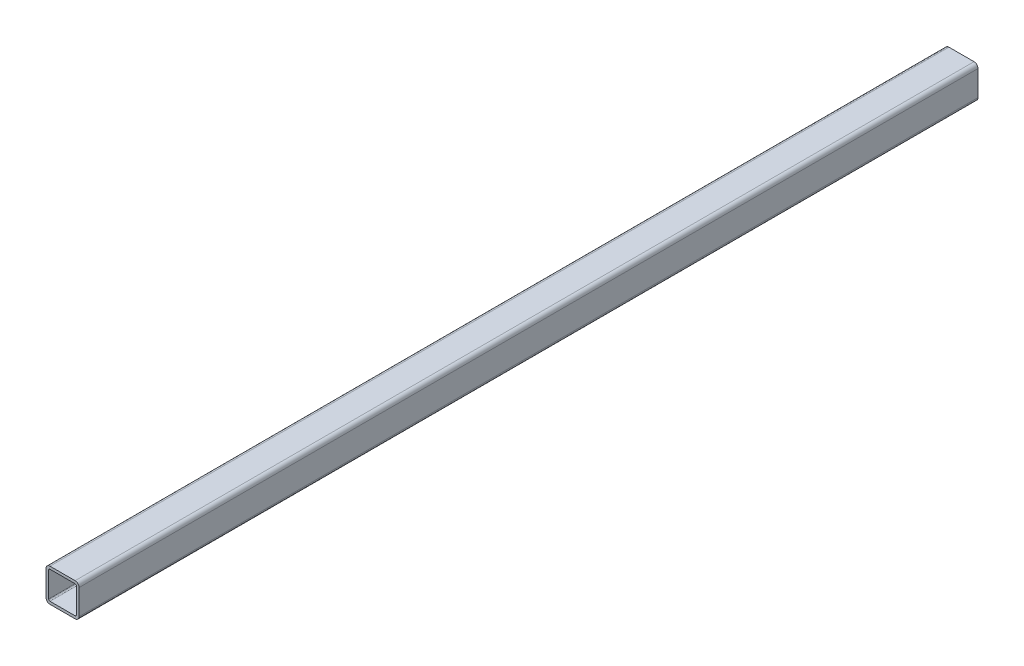
ISO-10303-21;
HEADER;
FILE_DESCRIPTION(('STEP AP214'),'2;1');
FILE_NAME('part.step','',(''),(''),'','','');
FILE_SCHEMA(('AUTOMOTIVE_DESIGN { 1 0 10303 214 1 1 1 1 }'));
ENDSEC;
DATA;
#1=APPLICATION_CONTEXT('core data for automotive mechanical design processes');
#2=APPLICATION_PROTOCOL_DEFINITION('international standard','automotive_design',2000,#1);
#3=PRODUCT_CONTEXT('',#1,'mechanical');
#4=PRODUCT('Part','Part','',(#3));
#5=PRODUCT_RELATED_PRODUCT_CATEGORY('part','',(#4));
#6=PRODUCT_DEFINITION_FORMATION('','',#4);
#7=PRODUCT_DEFINITION_CONTEXT('part definition',#1,'design');
#8=PRODUCT_DEFINITION('design','',#6,#7);
#9=PRODUCT_DEFINITION_SHAPE('','',#8);
#10=(LENGTH_UNIT() NAMED_UNIT(*) SI_UNIT(.MILLI.,.METRE.));
#11=(NAMED_UNIT(*) PLANE_ANGLE_UNIT() SI_UNIT($,.RADIAN.));
#12=(NAMED_UNIT(*) SI_UNIT($,.STERADIAN.) SOLID_ANGLE_UNIT());
#13=UNCERTAINTY_MEASURE_WITH_UNIT(LENGTH_MEASURE(1.E-05),#10,'distance_accuracy_value','');
#14=(GEOMETRIC_REPRESENTATION_CONTEXT(3) GLOBAL_UNCERTAINTY_ASSIGNED_CONTEXT((#13)) GLOBAL_UNIT_ASSIGNED_CONTEXT((#10,
#11,#12)) REPRESENTATION_CONTEXT('',''));
#15=CARTESIAN_POINT('',(0.,0.,0.));
#16=DIRECTION('',(0.,0.,1.));
#17=DIRECTION('',(1.,0.,0.));
#18=AXIS2_PLACEMENT_3D('',#15,#16,#17);
#19=CARTESIAN_POINT('',(-4.54747350886464E-12,-9.80993064558788E-12,680.000000000012));
#20=DIRECTION('',(0.,0.,1.));
#21=DIRECTION('',(1.,0.,0.));
#22=AXIS2_PLACEMENT_3D('',#19,#20,#21);
#23=PLANE('',#22);
#24=DIRECTION('',(0.,1.,0.));
#25=VECTOR('',#24,1.);
#26=CARTESIAN_POINT('',(-12.5000000000045,-4.75000000000982,680.000000000012));
#27=LINE('',#26,#25);
#28=CARTESIAN_POINT('',(-12.5000000000045,-9.50000000000982,680.000000000012));
#29=VERTEX_POINT('',#28);
#30=CARTESIAN_POINT('',(-12.5000000000045,9.49999999999018,680.000000000012));
#31=VERTEX_POINT('',#30);
#32=EDGE_CURVE('E222',#29,#31,#27,.T.);
#33=ORIENTED_EDGE('',*,*,#32,.F.);
#34=CARTESIAN_POINT('',(-9.50000000000458,-9.50000000000982,680.000000000012));
#35=DIRECTION('',(0.,0.,-1.));
#36=DIRECTION('',(1.,0.,0.));
#37=AXIS2_PLACEMENT_3D('',#34,#35,#36);
#38=CIRCLE('',#37,3.);
#39=CARTESIAN_POINT('',(-9.50000000000458,-12.5000000000098,680.000000000012));
#40=VERTEX_POINT('',#39);
#41=EDGE_CURVE('E186',#40,#29,#38,.T.);
#42=ORIENTED_EDGE('',*,*,#41,.F.);
#43=DIRECTION('',(-1.,0.,0.));
#44=VECTOR('',#43,1.);
#45=CARTESIAN_POINT('',(4.7499999999954,-12.5000000000098,680.000000000012));
#46=LINE('',#45,#44);
#47=CARTESIAN_POINT('',(9.49999999999548,-12.5000000000098,680.000000000012));
#48=VERTEX_POINT('',#47);
#49=EDGE_CURVE('E199',#48,#40,#46,.T.);
#50=ORIENTED_EDGE('',*,*,#49,.F.);
#51=CARTESIAN_POINT('',(9.49999999999548,-9.5000000000098,680.000000000012));
#52=DIRECTION('',(0.,0.,-1.));
#53=DIRECTION('',(0.,1.,0.));
#54=AXIS2_PLACEMENT_3D('',#51,#52,#53);
#55=CIRCLE('',#54,3.);
#56=CARTESIAN_POINT('',(12.4999999999955,-9.5000000000098,680.000000000012));
#57=VERTEX_POINT('',#56);
#58=EDGE_CURVE('E202',#57,#48,#55,.T.);
#59=ORIENTED_EDGE('',*,*,#58,.F.);
#60=DIRECTION('',(0.,-1.,0.));
#61=VECTOR('',#60,1.);
#62=CARTESIAN_POINT('',(12.4999999999955,4.7499999999902,680.000000000012));
#63=LINE('',#62,#61);
#64=CARTESIAN_POINT('',(12.4999999999955,9.4999999999902,680.000000000012));
#65=VERTEX_POINT('',#64);
#66=EDGE_CURVE('E218',#65,#57,#63,.T.);
#67=ORIENTED_EDGE('',*,*,#66,.F.);
#68=CARTESIAN_POINT('',(9.49999999999548,9.4999999999902,680.000000000012));
#69=DIRECTION('',(0.,0.,-1.));
#70=DIRECTION('',(-1.,0.,0.));
#71=AXIS2_PLACEMENT_3D('',#68,#69,#70);
#72=CIRCLE('',#71,3.);
#73=CARTESIAN_POINT('',(9.49999999999548,12.4999999999902,680.000000000012));
#74=VERTEX_POINT('',#73);
#75=EDGE_CURVE('E26',#74,#65,#72,.T.);
#76=ORIENTED_EDGE('',*,*,#75,.F.);
#77=DIRECTION('',(1.,0.,0.));
#78=VECTOR('',#77,1.);
#79=CARTESIAN_POINT('',(-4.75000000000449,12.4999999999902,680.000000000012));
#80=LINE('',#79,#78);
#81=CARTESIAN_POINT('',(-9.50000000000458,12.4999999999902,680.000000000012));
#82=VERTEX_POINT('',#81);
#83=EDGE_CURVE('E227',#82,#74,#80,.T.);
#84=ORIENTED_EDGE('',*,*,#83,.F.);
#85=CARTESIAN_POINT('',(-9.50000000000458,9.49999999999018,680.000000000012));
#86=DIRECTION('',(0.,0.,-1.));
#87=DIRECTION('',(0.,-1.,0.));
#88=AXIS2_PLACEMENT_3D('',#85,#86,#87);
#89=CIRCLE('',#88,3.);
#90=EDGE_CURVE('E248',#31,#82,#89,.T.);
#91=ORIENTED_EDGE('',*,*,#90,.F.);
#92=EDGE_LOOP('',(#33,#42,#50,#59,#67,#76,#84,#91));
#93=FACE_BOUND('',#92,.T.);
#94=DIRECTION('',(-1.,0.,0.));
#95=VECTOR('',#94,1.);
#96=CARTESIAN_POINT('',(-4.75000000000449,10.4999999999902,680.000000000012));
#97=LINE('',#96,#95);
#98=CARTESIAN_POINT('',(9.49999999999548,10.4999999999902,680.000000000012));
#99=VERTEX_POINT('',#98);
#100=CARTESIAN_POINT('',(-9.50000000000458,10.4999999999902,680.000000000012));
#101=VERTEX_POINT('',#100);
#102=EDGE_CURVE('E266',#99,#101,#97,.T.);
#103=ORIENTED_EDGE('',*,*,#102,.F.);
#104=CARTESIAN_POINT('',(9.49999999999548,9.4999999999902,680.000000000012));
#105=DIRECTION('',(0.,0.,1.));
#106=DIRECTION('',(-1.,0.,0.));
#107=AXIS2_PLACEMENT_3D('',#104,#105,#106);
#108=CIRCLE('',#107,1.);
#109=CARTESIAN_POINT('',(10.4999999999954,9.4999999999902,680.000000000012));
#110=VERTEX_POINT('',#109);
#111=EDGE_CURVE('E400',#110,#99,#108,.T.);
#112=ORIENTED_EDGE('',*,*,#111,.F.);
#113=DIRECTION('',(0.,1.,0.));
#114=VECTOR('',#113,1.);
#115=CARTESIAN_POINT('',(10.4999999999954,4.7499999999902,680.000000000012));
#116=LINE('',#115,#114);
#117=CARTESIAN_POINT('',(10.4999999999954,-9.5000000000098,680.000000000012));
#118=VERTEX_POINT('',#117);
#119=EDGE_CURVE('E246',#118,#110,#116,.T.);
#120=ORIENTED_EDGE('',*,*,#119,.F.);
#121=CARTESIAN_POINT('',(9.49999999999548,-9.5000000000098,680.000000000012));
#122=DIRECTION('',(0.,0.,1.));
#123=DIRECTION('',(0.,1.,0.));
#124=AXIS2_PLACEMENT_3D('',#121,#122,#123);
#125=CIRCLE('',#124,1.);
#126=CARTESIAN_POINT('',(9.49999999999548,-10.5000000000098,680.000000000012));
#127=VERTEX_POINT('',#126);
#128=EDGE_CURVE('E258',#127,#118,#125,.T.);
#129=ORIENTED_EDGE('',*,*,#128,.F.);
#130=DIRECTION('',(1.,0.,0.));
#131=VECTOR('',#130,1.);
#132=CARTESIAN_POINT('',(4.7499999999954,-10.5000000000098,680.000000000012));
#133=LINE('',#132,#131);
#134=CARTESIAN_POINT('',(-9.50000000000458,-10.5000000000098,680.000000000012));
#135=VERTEX_POINT('',#134);
#136=EDGE_CURVE('E272',#135,#127,#133,.T.);
#137=ORIENTED_EDGE('',*,*,#136,.F.);
#138=CARTESIAN_POINT('',(-9.50000000000458,-9.50000000000982,680.000000000012));
#139=DIRECTION('',(0.,0.,1.));
#140=DIRECTION('',(1.,0.,0.));
#141=AXIS2_PLACEMENT_3D('',#138,#139,#140);
#142=CIRCLE('',#141,1.);
#143=CARTESIAN_POINT('',(-10.5000000000045,-9.50000000000982,680.000000000012));
#144=VERTEX_POINT('',#143);
#145=EDGE_CURVE('E328',#144,#135,#142,.T.);
#146=ORIENTED_EDGE('',*,*,#145,.F.);
#147=DIRECTION('',(0.,-1.,0.));
#148=VECTOR('',#147,1.);
#149=CARTESIAN_POINT('',(-10.5000000000045,-4.75000000000982,680.000000000012));
#150=LINE('',#149,#148);
#151=CARTESIAN_POINT('',(-10.5000000000045,9.49999999999018,680.000000000012));
#152=VERTEX_POINT('',#151);
#153=EDGE_CURVE('E291',#152,#144,#150,.T.);
#154=ORIENTED_EDGE('',*,*,#153,.F.);
#155=CARTESIAN_POINT('',(-9.50000000000458,9.49999999999018,680.000000000012));
#156=DIRECTION('',(0.,0.,1.));
#157=DIRECTION('',(0.,-1.,0.));
#158=AXIS2_PLACEMENT_3D('',#155,#156,#157);
#159=CIRCLE('',#158,1.);
#160=EDGE_CURVE('E223',#101,#152,#159,.T.);
#161=ORIENTED_EDGE('',*,*,#160,.F.);
#162=EDGE_LOOP('',(#103,#112,#120,#129,#137,#146,#154,#161));
#163=FACE_BOUND('',#162,.T.);
#164=ADVANCED_FACE('F16',(#93,#163),#23,.T.);
#165=CARTESIAN_POINT('',(-7.38964445190504E-12,-9.80993064558788E-12,1.22213350550737E-11));
#166=DIRECTION('',(0.,0.,1.));
#167=DIRECTION('',(1.,0.,0.));
#168=AXIS2_PLACEMENT_3D('',#165,#166,#167);
#169=PLANE('',#168);
#170=DIRECTION('',(0.,1.,0.));
#171=VECTOR('',#170,1.);
#172=CARTESIAN_POINT('',(-12.5000000000074,-4.75000000000982,1.22213350550737E-11));
#173=LINE('',#172,#171);
#174=CARTESIAN_POINT('',(-12.5000000000074,-9.50000000000981,1.22213350550737E-11));
#175=VERTEX_POINT('',#174);
#176=CARTESIAN_POINT('',(-12.5000000000074,9.49999999999018,1.22213350550737E-11));
#177=VERTEX_POINT('',#176);
#178=EDGE_CURVE('E252',#175,#177,#173,.T.);
#179=ORIENTED_EDGE('',*,*,#178,.T.);
#180=CARTESIAN_POINT('',(-9.50000000000742,9.49999999999018,1.22213350550737E-11));
#181=DIRECTION('',(0.,0.,-1.));
#182=DIRECTION('',(0.,-1.,0.));
#183=AXIS2_PLACEMENT_3D('',#180,#181,#182);
#184=CIRCLE('',#183,3.);
#185=CARTESIAN_POINT('',(-9.50000000000742,12.4999999999902,1.22213350550737E-11));
#186=VERTEX_POINT('',#185);
#187=EDGE_CURVE('E234',#177,#186,#184,.T.);
#188=ORIENTED_EDGE('',*,*,#187,.T.);
#189=DIRECTION('',(1.,0.,0.));
#190=VECTOR('',#189,1.);
#191=CARTESIAN_POINT('',(-4.75000000000733,12.4999999999902,1.22213350550737E-11));
#192=LINE('',#191,#190);
#193=CARTESIAN_POINT('',(9.49999999999264,12.4999999999902,1.22213350550737E-11));
#194=VERTEX_POINT('',#193);
#195=EDGE_CURVE('E226',#186,#194,#192,.T.);
#196=ORIENTED_EDGE('',*,*,#195,.T.);
#197=CARTESIAN_POINT('',(9.49999999999264,9.4999999999902,1.19371179607697E-11));
#198=DIRECTION('',(0.,0.,-1.));
#199=DIRECTION('',(-1.,0.,0.));
#200=AXIS2_PLACEMENT_3D('',#197,#198,#199);
#201=CIRCLE('',#200,3.);
#202=CARTESIAN_POINT('',(12.4999999999926,9.4999999999902,1.19371179607697E-11));
#203=VERTEX_POINT('',#202);
#204=EDGE_CURVE('E11',#194,#203,#201,.T.);
#205=ORIENTED_EDGE('',*,*,#204,.T.);
#206=DIRECTION('',(0.,-1.,0.));
#207=VECTOR('',#206,1.);
#208=CARTESIAN_POINT('',(12.4999999999926,4.7499999999902,1.19371179607697E-11));
#209=LINE('',#208,#207);
#210=CARTESIAN_POINT('',(12.4999999999926,-9.5000000000098,1.19371179607697E-11));
#211=VERTEX_POINT('',#210);
#212=EDGE_CURVE('E194',#203,#211,#209,.T.);
#213=ORIENTED_EDGE('',*,*,#212,.T.);
#214=CARTESIAN_POINT('',(9.49999999999264,-9.5000000000098,1.19371179607697E-11));
#215=DIRECTION('',(0.,0.,-1.));
#216=DIRECTION('',(0.,1.,0.));
#217=AXIS2_PLACEMENT_3D('',#214,#215,#216);
#218=CIRCLE('',#217,3.);
#219=CARTESIAN_POINT('',(9.49999999999264,-12.5000000000098,1.19371179607697E-11));
#220=VERTEX_POINT('',#219);
#221=EDGE_CURVE('E189',#211,#220,#218,.T.);
#222=ORIENTED_EDGE('',*,*,#221,.T.);
#223=DIRECTION('',(-1.,0.,0.));
#224=VECTOR('',#223,1.);
#225=CARTESIAN_POINT('',(4.74999999999255,-12.5000000000098,1.19371179607697E-11));
#226=LINE('',#225,#224);
#227=CARTESIAN_POINT('',(-9.50000000000742,-12.5000000000098,1.19371179607697E-11));
#228=VERTEX_POINT('',#227);
#229=EDGE_CURVE('E174',#220,#228,#226,.T.);
#230=ORIENTED_EDGE('',*,*,#229,.T.);
#231=CARTESIAN_POINT('',(-9.50000000000742,-9.50000000000982,1.22213350550737E-11));
#232=DIRECTION('',(0.,0.,-1.));
#233=DIRECTION('',(1.,0.,0.));
#234=AXIS2_PLACEMENT_3D('',#231,#232,#233);
#235=CIRCLE('',#234,3.);
#236=EDGE_CURVE('E263',#228,#175,#235,.T.);
#237=ORIENTED_EDGE('',*,*,#236,.T.);
#238=EDGE_LOOP('',(#179,#188,#196,#205,#213,#222,#230,#237));
#239=FACE_BOUND('',#238,.T.);
#240=DIRECTION('',(-1.,0.,0.));
#241=VECTOR('',#240,1.);
#242=CARTESIAN_POINT('',(-4.75000000000733,10.4999999999902,1.22213350550737E-11));
#243=LINE('',#242,#241);
#244=CARTESIAN_POINT('',(9.49999999999264,10.4999999999902,1.19371179607697E-11));
#245=VERTEX_POINT('',#244);
#246=CARTESIAN_POINT('',(-9.50000000000742,10.4999999999902,1.22213350550737E-11));
#247=VERTEX_POINT('',#246);
#248=EDGE_CURVE('E277',#245,#247,#243,.T.);
#249=ORIENTED_EDGE('',*,*,#248,.T.);
#250=CARTESIAN_POINT('',(-9.50000000000742,9.49999999999018,1.22213350550737E-11));
#251=DIRECTION('',(0.,0.,1.));
#252=DIRECTION('',(0.,-1.,0.));
#253=AXIS2_PLACEMENT_3D('',#250,#251,#252);
#254=CIRCLE('',#253,1.);
#255=CARTESIAN_POINT('',(-10.5000000000074,9.49999999999018,1.22213350550737E-11));
#256=VERTEX_POINT('',#255);
#257=EDGE_CURVE('E220',#247,#256,#254,.T.);
#258=ORIENTED_EDGE('',*,*,#257,.T.);
#259=DIRECTION('',(0.,-1.,0.));
#260=VECTOR('',#259,1.);
#261=CARTESIAN_POINT('',(-10.5000000000074,-4.75000000000982,1.22213350550737E-11));
#262=LINE('',#261,#260);
#263=CARTESIAN_POINT('',(-10.5000000000074,-9.50000000000982,1.22213350550737E-11));
#264=VERTEX_POINT('',#263);
#265=EDGE_CURVE('E294',#256,#264,#262,.T.);
#266=ORIENTED_EDGE('',*,*,#265,.T.);
#267=CARTESIAN_POINT('',(-9.50000000000742,-9.50000000000982,1.22213350550737E-11));
#268=DIRECTION('',(0.,0.,1.));
#269=DIRECTION('',(1.,0.,0.));
#270=AXIS2_PLACEMENT_3D('',#267,#268,#269);
#271=CIRCLE('',#270,1.);
#272=CARTESIAN_POINT('',(-9.50000000000742,-10.5000000000098,1.22213350550737E-11));
#273=VERTEX_POINT('',#272);
#274=EDGE_CURVE('E325',#264,#273,#271,.T.);
#275=ORIENTED_EDGE('',*,*,#274,.T.);
#276=DIRECTION('',(1.,0.,0.));
#277=VECTOR('',#276,1.);
#278=CARTESIAN_POINT('',(4.74999999999255,-10.5000000000098,1.19371179607697E-11));
#279=LINE('',#278,#277);
#280=CARTESIAN_POINT('',(9.49999999999264,-10.5000000000098,1.19371179607697E-11));
#281=VERTEX_POINT('',#280);
#282=EDGE_CURVE('E271',#273,#281,#279,.T.);
#283=ORIENTED_EDGE('',*,*,#282,.T.);
#284=CARTESIAN_POINT('',(9.49999999999264,-9.5000000000098,1.19371179607697E-11));
#285=DIRECTION('',(0.,0.,1.));
#286=DIRECTION('',(0.,1.,0.));
#287=AXIS2_PLACEMENT_3D('',#284,#285,#286);
#288=CIRCLE('',#287,1.);
#289=CARTESIAN_POINT('',(10.4999999999926,-9.5000000000098,1.19371179607697E-11));
#290=VERTEX_POINT('',#289);
#291=EDGE_CURVE('E257',#281,#290,#288,.T.);
#292=ORIENTED_EDGE('',*,*,#291,.T.);
#293=DIRECTION('',(0.,1.,0.));
#294=VECTOR('',#293,1.);
#295=CARTESIAN_POINT('',(10.4999999999926,4.74999999999019,1.19371179607697E-11));
#296=LINE('',#295,#294);
#297=CARTESIAN_POINT('',(10.4999999999926,9.4999999999902,1.19371179607697E-11));
#298=VERTEX_POINT('',#297);
#299=EDGE_CURVE('E408',#290,#298,#296,.T.);
#300=ORIENTED_EDGE('',*,*,#299,.T.);
#301=CARTESIAN_POINT('',(9.49999999999264,9.4999999999902,1.19371179607697E-11));
#302=DIRECTION('',(0.,0.,1.));
#303=DIRECTION('',(-1.,0.,0.));
#304=AXIS2_PLACEMENT_3D('',#301,#302,#303);
#305=CIRCLE('',#304,1.);
#306=EDGE_CURVE('E214',#298,#245,#305,.T.);
#307=ORIENTED_EDGE('',*,*,#306,.T.);
#308=EDGE_LOOP('',(#249,#258,#266,#275,#283,#292,#300,#307));
#309=FACE_BOUND('',#308,.T.);
#310=ADVANCED_FACE('F191',(#239,#309),#169,.F.);
#311=CARTESIAN_POINT('',(9.49999999999264,9.4999999999902,1.19371179607697E-11));
#312=DIRECTION('',(0.,0.,1.));
#313=DIRECTION('',(-1.,0.,0.));
#314=AXIS2_PLACEMENT_3D('',#311,#312,#313);
#315=CYLINDRICAL_SURFACE('',#314,3.);
#316=ORIENTED_EDGE('',*,*,#75,.T.);
#317=DIRECTION('',(0.,0.,1.));
#318=VECTOR('',#317,1.);
#319=CARTESIAN_POINT('',(12.4999999999926,9.4999999999902,1.19371179607697E-11));
#320=LINE('',#319,#318);
#321=EDGE_CURVE('E209',#203,#65,#320,.T.);
#322=ORIENTED_EDGE('',*,*,#321,.F.);
#323=ORIENTED_EDGE('',*,*,#204,.F.);
#324=DIRECTION('',(0.,0.,1.));
#325=VECTOR('',#324,1.);
#326=CARTESIAN_POINT('',(9.49999999999264,12.4999999999902,1.22213350550737E-11));
#327=LINE('',#326,#325);
#328=EDGE_CURVE('E224',#194,#74,#327,.T.);
#329=ORIENTED_EDGE('',*,*,#328,.T.);
#330=EDGE_LOOP('',(#316,#322,#323,#329));
#331=FACE_BOUND('',#330,.T.);
#332=ADVANCED_FACE('F516',(#331),#315,.T.);
#333=CARTESIAN_POINT('',(-9.50000000000742,12.4999999999902,1.22213350550737E-11));
#334=DIRECTION('',(0.,1.,0.));
#335=DIRECTION('',(1.,0.,0.));
#336=AXIS2_PLACEMENT_3D('',#333,#334,#335);
#337=PLANE('',#336);
#338=ORIENTED_EDGE('',*,*,#83,.T.);
#339=ORIENTED_EDGE('',*,*,#328,.F.);
#340=ORIENTED_EDGE('',*,*,#195,.F.);
#341=DIRECTION('',(0.,0.,1.));
#342=VECTOR('',#341,1.);
#343=CARTESIAN_POINT('',(-9.50000000000742,12.4999999999902,1.22213350550737E-11));
#344=LINE('',#343,#342);
#345=EDGE_CURVE('E242',#186,#82,#344,.T.);
#346=ORIENTED_EDGE('',*,*,#345,.T.);
#347=EDGE_LOOP('',(#338,#339,#340,#346));
#348=FACE_BOUND('',#347,.T.);
#349=ADVANCED_FACE('F586',(#348),#337,.T.);
#350=CARTESIAN_POINT('',(-9.50000000000742,9.49999999999018,1.22213350550737E-11));
#351=DIRECTION('',(0.,0.,1.));
#352=DIRECTION('',(0.,-1.,0.));
#353=AXIS2_PLACEMENT_3D('',#350,#351,#352);
#354=CYLINDRICAL_SURFACE('',#353,3.);
#355=ORIENTED_EDGE('',*,*,#90,.T.);
#356=ORIENTED_EDGE('',*,*,#345,.F.);
#357=ORIENTED_EDGE('',*,*,#187,.F.);
#358=DIRECTION('',(0.,0.,1.));
#359=VECTOR('',#358,1.);
#360=CARTESIAN_POINT('',(-12.5000000000074,9.49999999999018,1.22213350550737E-11));
#361=LINE('',#360,#359);
#362=EDGE_CURVE('E301',#177,#31,#361,.T.);
#363=ORIENTED_EDGE('',*,*,#362,.T.);
#364=EDGE_LOOP('',(#355,#356,#357,#363));
#365=FACE_BOUND('',#364,.T.);
#366=ADVANCED_FACE('F346',(#365),#354,.T.);
#367=CARTESIAN_POINT('',(-12.5000000000074,-9.50000000000981,1.22213350550737E-11));
#368=DIRECTION('',(-1.,0.,0.));
#369=DIRECTION('',(0.,1.,0.));
#370=AXIS2_PLACEMENT_3D('',#367,#368,#369);
#371=PLANE('',#370);
#372=ORIENTED_EDGE('',*,*,#32,.T.);
#373=ORIENTED_EDGE('',*,*,#362,.F.);
#374=ORIENTED_EDGE('',*,*,#178,.F.);
#375=DIRECTION('',(0.,0.,1.));
#376=VECTOR('',#375,1.);
#377=CARTESIAN_POINT('',(-12.5000000000074,-9.50000000000981,1.22213350550737E-11));
#378=LINE('',#377,#376);
#379=EDGE_CURVE('E259',#175,#29,#378,.T.);
#380=ORIENTED_EDGE('',*,*,#379,.T.);
#381=EDGE_LOOP('',(#372,#373,#374,#380));
#382=FACE_BOUND('',#381,.T.);
#383=CARTESIAN_POINT('',(-12.5000000000057,2.99999996462933,390.667443760147));
#384=DIRECTION('',(1.,0.,0.));
#385=DIRECTION('',(0.,1.,0.));
#386=AXIS2_PLACEMENT_3D('',#383,#384,#385);
#387=CIRCLE('',#386,3.3235);
#388=CARTESIAN_POINT('',(-12.5000000000057,6.32349996462933,390.667443760147));
#389=VERTEX_POINT('',#388);
#390=EDGE_CURVE('E321',#389,#389,#387,.T.);
#391=ORIENTED_EDGE('',*,*,#390,.T.);
#392=EDGE_LOOP('',(#391));
#393=FACE_BOUND('',#392,.T.);
#394=CARTESIAN_POINT('',(-12.5000000000053,2.99999996463511,500.667443760141));
#395=DIRECTION('',(1.,0.,0.));
#396=DIRECTION('',(0.,1.,0.));
#397=AXIS2_PLACEMENT_3D('',#394,#395,#396);
#398=CIRCLE('',#397,3.3235);
#399=CARTESIAN_POINT('',(-12.5000000000053,6.32349996463511,500.667443760141));
#400=VERTEX_POINT('',#399);
#401=EDGE_CURVE('E351',#400,#400,#398,.T.);
#402=ORIENTED_EDGE('',*,*,#401,.T.);
#403=EDGE_LOOP('',(#402));
#404=FACE_BOUND('',#403,.T.);
#405=ADVANCED_FACE('F342',(#382,#393,#404),#371,.T.);
#406=CARTESIAN_POINT('',(-9.50000000000742,9.49999999999018,1.22213350550737E-11));
#407=DIRECTION('',(0.,0.,1.));
#408=DIRECTION('',(0.,-1.,0.));
#409=AXIS2_PLACEMENT_3D('',#406,#407,#408);
#410=CYLINDRICAL_SURFACE('',#409,1.);
#411=ORIENTED_EDGE('',*,*,#160,.T.);
#412=DIRECTION('',(0.,0.,1.));
#413=VECTOR('',#412,1.);
#414=CARTESIAN_POINT('',(-10.5000000000074,9.49999999999018,1.22213350550737E-11));
#415=LINE('',#414,#413);
#416=EDGE_CURVE('E296',#256,#152,#415,.T.);
#417=ORIENTED_EDGE('',*,*,#416,.F.);
#418=ORIENTED_EDGE('',*,*,#257,.F.);
#419=DIRECTION('',(0.,0.,1.));
#420=VECTOR('',#419,1.);
#421=CARTESIAN_POINT('',(-9.50000000000742,10.4999999999902,1.22213350550737E-11));
#422=LINE('',#421,#420);
#423=EDGE_CURVE('E273',#247,#101,#422,.T.);
#424=ORIENTED_EDGE('',*,*,#423,.T.);
#425=EDGE_LOOP('',(#411,#417,#418,#424));
#426=FACE_BOUND('',#425,.T.);
#427=ADVANCED_FACE('F345',(#426),#410,.F.);
#428=CARTESIAN_POINT('',(-10.5000000000074,-9.50000000000982,1.22213350550737E-11));
#429=DIRECTION('',(-1.,0.,0.));
#430=DIRECTION('',(0.,1.,0.));
#431=AXIS2_PLACEMENT_3D('',#428,#429,#430);
#432=PLANE('',#431);
#433=ORIENTED_EDGE('',*,*,#153,.T.);
#434=DIRECTION('',(0.,0.,1.));
#435=VECTOR('',#434,1.);
#436=CARTESIAN_POINT('',(-10.5000000000074,-9.50000000000982,1.22213350550737E-11));
#437=LINE('',#436,#435);
#438=EDGE_CURVE('E295',#264,#144,#437,.T.);
#439=ORIENTED_EDGE('',*,*,#438,.F.);
#440=ORIENTED_EDGE('',*,*,#265,.F.);
#441=ORIENTED_EDGE('',*,*,#416,.T.);
#442=EDGE_LOOP('',(#433,#439,#440,#441));
#443=FACE_BOUND('',#442,.T.);
#444=CARTESIAN_POINT('',(-10.5000000000057,2.99999996462933,390.667443760147));
#445=DIRECTION('',(-1.,0.,0.));
#446=DIRECTION('',(0.,1.,0.));
#447=AXIS2_PLACEMENT_3D('',#444,#445,#446);
#448=CIRCLE('',#447,3.3235);
#449=CARTESIAN_POINT('',(-10.5000000000057,-0.323500035370667,390.667443760147));
#450=VERTEX_POINT('',#449);
#451=EDGE_CURVE('E331',#450,#450,#448,.T.);
#452=ORIENTED_EDGE('',*,*,#451,.T.);
#453=EDGE_LOOP('',(#452));
#454=FACE_BOUND('',#453,.T.);
#455=CARTESIAN_POINT('',(-10.5000000000052,2.99999996463511,500.667443760141));
#456=DIRECTION('',(-1.,0.,0.));
#457=DIRECTION('',(0.,1.,0.));
#458=AXIS2_PLACEMENT_3D('',#455,#456,#457);
#459=CIRCLE('',#458,3.3235);
#460=CARTESIAN_POINT('',(-10.5000000000052,-0.323500035364892,500.667443760141));
#461=VERTEX_POINT('',#460);
#462=EDGE_CURVE('E316',#461,#461,#459,.T.);
#463=ORIENTED_EDGE('',*,*,#462,.T.);
#464=EDGE_LOOP('',(#463));
#465=FACE_BOUND('',#464,.T.);
#466=ADVANCED_FACE('F539',(#443,#454,#465),#432,.F.);
#467=CARTESIAN_POINT('',(-9.50000000000742,-9.50000000000982,1.22213350550737E-11));
#468=DIRECTION('',(0.,0.,1.));
#469=DIRECTION('',(1.,0.,0.));
#470=AXIS2_PLACEMENT_3D('',#467,#468,#469);
#471=CYLINDRICAL_SURFACE('',#470,1.);
#472=ORIENTED_EDGE('',*,*,#145,.T.);
#473=DIRECTION('',(0.,0.,1.));
#474=VECTOR('',#473,1.);
#475=CARTESIAN_POINT('',(-9.50000000000742,-10.5000000000098,1.22213350550737E-11));
#476=LINE('',#475,#474);
#477=EDGE_CURVE('E283',#273,#135,#476,.T.);
#478=ORIENTED_EDGE('',*,*,#477,.F.);
#479=ORIENTED_EDGE('',*,*,#274,.F.);
#480=ORIENTED_EDGE('',*,*,#438,.T.);
#481=EDGE_LOOP('',(#472,#478,#479,#480));
#482=FACE_BOUND('',#481,.T.);
#483=ADVANCED_FACE('F563',(#482),#471,.F.);
#484=CARTESIAN_POINT('',(-9.50000000000742,10.4999999999902,1.22213350550737E-11));
#485=DIRECTION('',(0.,1.,0.));
#486=DIRECTION('',(1.,0.,0.));
#487=AXIS2_PLACEMENT_3D('',#484,#485,#486);
#488=PLANE('',#487);
#489=ORIENTED_EDGE('',*,*,#102,.T.);
#490=ORIENTED_EDGE('',*,*,#423,.F.);
#491=ORIENTED_EDGE('',*,*,#248,.F.);
#492=DIRECTION('',(0.,0.,1.));
#493=VECTOR('',#492,1.);
#494=CARTESIAN_POINT('',(9.49999999999264,10.4999999999902,1.19371179607697E-11));
#495=LINE('',#494,#493);
#496=EDGE_CURVE('E219',#245,#99,#495,.T.);
#497=ORIENTED_EDGE('',*,*,#496,.T.);
#498=EDGE_LOOP('',(#489,#490,#491,#497));
#499=FACE_BOUND('',#498,.T.);
#500=ADVANCED_FACE('F574',(#499),#488,.F.);
#501=CARTESIAN_POINT('',(-9.50000000000742,-9.50000000000982,1.22213350550737E-11));
#502=DIRECTION('',(0.,0.,1.));
#503=DIRECTION('',(1.,0.,0.));
#504=AXIS2_PLACEMENT_3D('',#501,#502,#503);
#505=CYLINDRICAL_SURFACE('',#504,3.);
#506=ORIENTED_EDGE('',*,*,#41,.T.);
#507=ORIENTED_EDGE('',*,*,#379,.F.);
#508=ORIENTED_EDGE('',*,*,#236,.F.);
#509=DIRECTION('',(0.,0.,1.));
#510=VECTOR('',#509,1.);
#511=CARTESIAN_POINT('',(-9.50000000000742,-12.5000000000098,1.19371179607697E-11));
#512=LINE('',#511,#510);
#513=EDGE_CURVE('E182',#228,#40,#512,.T.);
#514=ORIENTED_EDGE('',*,*,#513,.T.);
#515=EDGE_LOOP('',(#506,#507,#508,#514));
#516=FACE_BOUND('',#515,.T.);
#517=ADVANCED_FACE('F18',(#516),#505,.T.);
#518=CARTESIAN_POINT('',(9.49999999999264,-12.5000000000098,1.19371179607697E-11));
#519=DIRECTION('',(0.,-1.,0.));
#520=DIRECTION('',(0.,0.,-1.));
#521=AXIS2_PLACEMENT_3D('',#518,#519,#520);
#522=PLANE('',#521);
#523=ORIENTED_EDGE('',*,*,#49,.T.);
#524=ORIENTED_EDGE('',*,*,#513,.F.);
#525=ORIENTED_EDGE('',*,*,#229,.F.);
#526=DIRECTION('',(0.,0.,1.));
#527=VECTOR('',#526,1.);
#528=CARTESIAN_POINT('',(9.49999999999264,-12.5000000000098,1.19371179607697E-11));
#529=LINE('',#528,#527);
#530=EDGE_CURVE('E179',#220,#48,#529,.T.);
#531=ORIENTED_EDGE('',*,*,#530,.T.);
#532=EDGE_LOOP('',(#523,#524,#525,#531));
#533=FACE_BOUND('',#532,.T.);
#534=ADVANCED_FACE('F177',(#533),#522,.T.);
#535=CARTESIAN_POINT('',(9.49999999999264,-9.5000000000098,1.19371179607697E-11));
#536=DIRECTION('',(0.,0.,1.));
#537=DIRECTION('',(0.,1.,0.));
#538=AXIS2_PLACEMENT_3D('',#535,#536,#537);
#539=CYLINDRICAL_SURFACE('',#538,3.);
#540=ORIENTED_EDGE('',*,*,#58,.T.);
#541=ORIENTED_EDGE('',*,*,#530,.F.);
#542=ORIENTED_EDGE('',*,*,#221,.F.);
#543=DIRECTION('',(0.,0.,1.));
#544=VECTOR('',#543,1.);
#545=CARTESIAN_POINT('',(12.4999999999926,-9.5000000000098,1.19371179607697E-11));
#546=LINE('',#545,#544);
#547=EDGE_CURVE('E287',#211,#57,#546,.T.);
#548=ORIENTED_EDGE('',*,*,#547,.T.);
#549=EDGE_LOOP('',(#540,#541,#542,#548));
#550=FACE_BOUND('',#549,.T.);
#551=ADVANCED_FACE('F201',(#550),#539,.T.);
#552=CARTESIAN_POINT('',(12.4999999999926,9.4999999999902,1.19371179607697E-11));
#553=DIRECTION('',(1.,0.,0.));
#554=DIRECTION('',(0.,0.,-1.));
#555=AXIS2_PLACEMENT_3D('',#552,#553,#554);
#556=PLANE('',#555);
#557=ORIENTED_EDGE('',*,*,#66,.T.);
#558=ORIENTED_EDGE('',*,*,#547,.F.);
#559=ORIENTED_EDGE('',*,*,#212,.F.);
#560=ORIENTED_EDGE('',*,*,#321,.T.);
#561=EDGE_LOOP('',(#557,#558,#559,#560));
#562=FACE_BOUND('',#561,.T.);
#563=ADVANCED_FACE('F517',(#562),#556,.T.);
#564=CARTESIAN_POINT('',(9.49999999999264,9.4999999999902,1.19371179607697E-11));
#565=DIRECTION('',(0.,0.,1.));
#566=DIRECTION('',(-1.,0.,0.));
#567=AXIS2_PLACEMENT_3D('',#564,#565,#566);
#568=CYLINDRICAL_SURFACE('',#567,1.);
#569=ORIENTED_EDGE('',*,*,#111,.T.);
#570=ORIENTED_EDGE('',*,*,#496,.F.);
#571=ORIENTED_EDGE('',*,*,#306,.F.);
#572=DIRECTION('',(0.,0.,1.));
#573=VECTOR('',#572,1.);
#574=CARTESIAN_POINT('',(10.4999999999926,9.4999999999902,1.19371179607697E-11));
#575=LINE('',#574,#573);
#576=EDGE_CURVE('E417',#298,#110,#575,.T.);
#577=ORIENTED_EDGE('',*,*,#576,.T.);
#578=EDGE_LOOP('',(#569,#570,#571,#577));
#579=FACE_BOUND('',#578,.T.);
#580=ADVANCED_FACE('F519',(#579),#568,.F.);
#581=CARTESIAN_POINT('',(10.4999999999926,9.4999999999902,1.19371179607697E-11));
#582=DIRECTION('',(1.,0.,0.));
#583=DIRECTION('',(0.,0.,-1.));
#584=AXIS2_PLACEMENT_3D('',#581,#582,#583);
#585=PLANE('',#584);
#586=ORIENTED_EDGE('',*,*,#119,.T.);
#587=ORIENTED_EDGE('',*,*,#576,.F.);
#588=ORIENTED_EDGE('',*,*,#299,.F.);
#589=DIRECTION('',(0.,0.,1.));
#590=VECTOR('',#589,1.);
#591=CARTESIAN_POINT('',(10.4999999999926,-9.5000000000098,1.19371179607697E-11));
#592=LINE('',#591,#590);
#593=EDGE_CURVE('E253',#290,#118,#592,.T.);
#594=ORIENTED_EDGE('',*,*,#593,.T.);
#595=EDGE_LOOP('',(#586,#587,#588,#594));
#596=FACE_BOUND('',#595,.T.);
#597=ADVANCED_FACE('F526',(#596),#585,.F.);
#598=CARTESIAN_POINT('',(9.49999999999264,-9.5000000000098,1.19371179607697E-11));
#599=DIRECTION('',(0.,0.,1.));
#600=DIRECTION('',(0.,1.,0.));
#601=AXIS2_PLACEMENT_3D('',#598,#599,#600);
#602=CYLINDRICAL_SURFACE('',#601,1.);
#603=ORIENTED_EDGE('',*,*,#128,.T.);
#604=ORIENTED_EDGE('',*,*,#593,.F.);
#605=ORIENTED_EDGE('',*,*,#291,.F.);
#606=DIRECTION('',(0.,0.,1.));
#607=VECTOR('',#606,1.);
#608=CARTESIAN_POINT('',(9.49999999999264,-10.5000000000098,1.19371179607697E-11));
#609=LINE('',#608,#607);
#610=EDGE_CURVE('E267',#281,#127,#609,.T.);
#611=ORIENTED_EDGE('',*,*,#610,.T.);
#612=EDGE_LOOP('',(#603,#604,#605,#611));
#613=FACE_BOUND('',#612,.T.);
#614=ADVANCED_FACE('F541',(#613),#602,.F.);
#615=CARTESIAN_POINT('',(9.49999999999264,-10.5000000000098,1.19371179607697E-11));
#616=DIRECTION('',(0.,-1.,0.));
#617=DIRECTION('',(0.,0.,-1.));
#618=AXIS2_PLACEMENT_3D('',#615,#616,#617);
#619=PLANE('',#618);
#620=ORIENTED_EDGE('',*,*,#136,.T.);
#621=ORIENTED_EDGE('',*,*,#610,.F.);
#622=ORIENTED_EDGE('',*,*,#282,.F.);
#623=ORIENTED_EDGE('',*,*,#477,.T.);
#624=EDGE_LOOP('',(#620,#621,#622,#623));
#625=FACE_BOUND('',#624,.T.);
#626=ADVANCED_FACE('F543',(#625),#619,.F.);
#627=CARTESIAN_POINT('',(-7.75000000000574,2.99999996462933,390.667443760147));
#628=DIRECTION('',(-1.,0.,0.));
#629=DIRECTION('',(0.,1.,0.));
#630=AXIS2_PLACEMENT_3D('',#627,#628,#629);
#631=CYLINDRICAL_SURFACE('',#630,3.3235);
#632=ORIENTED_EDGE('',*,*,#390,.F.);
#633=EDGE_LOOP('',(#632));
#634=FACE_BOUND('',#633,.T.);
#635=ORIENTED_EDGE('',*,*,#451,.F.);
#636=EDGE_LOOP('',(#635));
#637=FACE_BOUND('',#636,.T.);
#638=ADVANCED_FACE('F549',(#634,#637),#631,.F.);
#639=CARTESIAN_POINT('',(-7.75000000000531,2.99999996463511,500.667443760141));
#640=DIRECTION('',(-1.,0.,0.));
#641=DIRECTION('',(0.,1.,0.));
#642=AXIS2_PLACEMENT_3D('',#639,#640,#641);
#643=CYLINDRICAL_SURFACE('',#642,3.3235);
#644=ORIENTED_EDGE('',*,*,#401,.F.);
#645=EDGE_LOOP('',(#644));
#646=FACE_BOUND('',#645,.T.);
#647=ORIENTED_EDGE('',*,*,#462,.F.);
#648=EDGE_LOOP('',(#647));
#649=FACE_BOUND('',#648,.T.);
#650=ADVANCED_FACE('F596',(#646,#649),#643,.F.);
#651=CLOSED_SHELL('',(#164,#310,#332,#349,#366,#405,#427,#466,#483,#500,#517,#534,#551,#563,
#580,#597,#614,#626,#638,#650));
#652=MANIFOLD_SOLID_BREP('B1',#651);
#653=ADVANCED_BREP_SHAPE_REPRESENTATION('',(#18,#652),#14);
#654=SHAPE_DEFINITION_REPRESENTATION(#9,#653);
ENDSEC;
END-ISO-10303-21;
